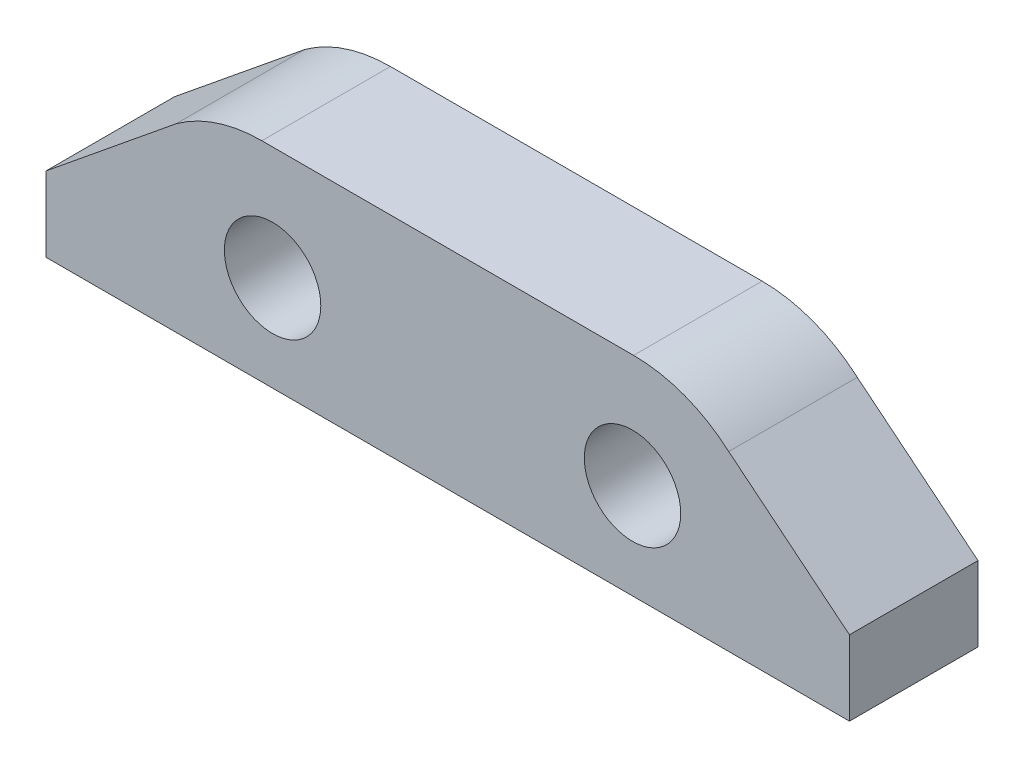
ISO-10303-21;
HEADER;
FILE_DESCRIPTION(('STEP AP214'),'2;1');
FILE_NAME('part.step','',(''),(''),'','','');
FILE_SCHEMA(('AUTOMOTIVE_DESIGN { 1 0 10303 214 1 1 1 1 }'));
ENDSEC;
DATA;
#1=APPLICATION_CONTEXT('core data for automotive mechanical design processes');
#2=APPLICATION_PROTOCOL_DEFINITION('international standard','automotive_design',2000,#1);
#3=PRODUCT_CONTEXT('',#1,'mechanical');
#4=PRODUCT('Part','Part','',(#3));
#5=PRODUCT_RELATED_PRODUCT_CATEGORY('part','',(#4));
#6=PRODUCT_DEFINITION_FORMATION('','',#4);
#7=PRODUCT_DEFINITION_CONTEXT('part definition',#1,'design');
#8=PRODUCT_DEFINITION('design','',#6,#7);
#9=PRODUCT_DEFINITION_SHAPE('','',#8);
#10=(LENGTH_UNIT() NAMED_UNIT(*) SI_UNIT(.MILLI.,.METRE.));
#11=(NAMED_UNIT(*) PLANE_ANGLE_UNIT() SI_UNIT($,.RADIAN.));
#12=(NAMED_UNIT(*) SI_UNIT($,.STERADIAN.) SOLID_ANGLE_UNIT());
#13=UNCERTAINTY_MEASURE_WITH_UNIT(LENGTH_MEASURE(1.E-05),#10,'distance_accuracy_value','');
#14=(GEOMETRIC_REPRESENTATION_CONTEXT(3) GLOBAL_UNCERTAINTY_ASSIGNED_CONTEXT((#13)) GLOBAL_UNIT_ASSIGNED_CONTEXT((#10,
#11,#12)) REPRESENTATION_CONTEXT('',''));
#15=CARTESIAN_POINT('',(0.,0.,0.));
#16=DIRECTION('',(0.,0.,1.));
#17=DIRECTION('',(1.,0.,0.));
#18=AXIS2_PLACEMENT_3D('',#15,#16,#17);
#19=CARTESIAN_POINT('',(11.1165308610014,13.6417056667107,8.00000018998981));
#20=DIRECTION('',(-0.631709390002312,-0.775205293185558,0.));
#21=DIRECTION('',(0.775205293185558,-0.631709390002312,0.));
#22=AXIS2_PLACEMENT_3D('',#19,#20,#21);
#23=PLANE('',#22);
#24=DIRECTION('',(-0.775205293185558,0.631709390002312,0.));
#25=VECTOR('',#24,1.);
#26=CARTESIAN_POINT('',(11.1165308610014,13.6417056667107,4.00000018998981));
#27=LINE('',#26,#25);
#28=CARTESIAN_POINT('',(25.0000022351742,2.32816161587835,4.00000018998981));
#29=VERTEX_POINT('',#28);
#30=CARTESIAN_POINT('',(21.2440187194801,5.38888640248,4.00000018998981));
#31=VERTEX_POINT('',#30);
#32=EDGE_CURVE('E155',#29,#31,#27,.T.);
#33=ORIENTED_EDGE('',*,*,#32,.T.);
#34=DIRECTION('',(0.,0.,-1.));
#35=VECTOR('',#34,1.);
#36=CARTESIAN_POINT('',(21.2440187194801,5.38888640248,8.00000018998981));
#37=LINE('',#36,#35);
#38=CARTESIAN_POINT('',(21.2440187194801,5.38888640248,8.00000018998981));
#39=VERTEX_POINT('',#38);
#40=EDGE_CURVE('E11',#39,#31,#37,.T.);
#41=ORIENTED_EDGE('',*,*,#40,.F.);
#42=DIRECTION('',(-0.775205293185558,0.631709390002312,0.));
#43=VECTOR('',#42,1.);
#44=CARTESIAN_POINT('',(11.1165308610014,13.6417056667107,8.00000018998981));
#45=LINE('',#44,#43);
#46=CARTESIAN_POINT('',(25.0000022351742,2.32816161587835,8.00000018998981));
#47=VERTEX_POINT('',#46);
#48=EDGE_CURVE('E218',#47,#39,#45,.T.);
#49=ORIENTED_EDGE('',*,*,#48,.F.);
#50=DIRECTION('',(0.,0.,-1.));
#51=VECTOR('',#50,1.);
#52=CARTESIAN_POINT('',(25.0000022351742,2.32816161587835,8.00000018998981));
#53=LINE('',#52,#51);
#54=EDGE_CURVE('E63',#47,#29,#53,.T.);
#55=ORIENTED_EDGE('',*,*,#54,.T.);
#56=EDGE_LOOP('',(#33,#41,#49,#55));
#57=FACE_BOUND('',#56,.T.);
#58=ADVANCED_FACE('F45',(#57),#23,.F.);
#59=CARTESIAN_POINT('',(18.2833691493808,2.00000004058979,8.00000018998981));
#60=DIRECTION('',(0.,0.,-1.));
#61=DIRECTION('',(-1.,0.,0.));
#62=AXIS2_PLACEMENT_3D('',#59,#60,#61);
#63=CYLINDRICAL_SURFACE('',#62,4.49999962785938);
#64=CARTESIAN_POINT('',(18.2833691493808,2.00000004058979,4.00000018998981));
#65=DIRECTION('',(0.,0.,1.));
#66=DIRECTION('',(1.,0.,0.));
#67=AXIS2_PLACEMENT_3D('',#64,#65,#66);
#68=CIRCLE('',#67,4.49999962785938);
#69=CARTESIAN_POINT('',(18.2833691493808,6.49999966844917,4.00000018998981));
#70=VERTEX_POINT('',#69);
#71=EDGE_CURVE('E158',#31,#70,#68,.T.);
#72=ORIENTED_EDGE('',*,*,#71,.T.);
#73=DIRECTION('',(0.,0.,-1.));
#74=VECTOR('',#73,1.);
#75=CARTESIAN_POINT('',(18.2833691493808,6.49999966844917,8.00000018998981));
#76=LINE('',#75,#74);
#77=CARTESIAN_POINT('',(18.2833691493808,6.49999966844917,8.00000018998981));
#78=VERTEX_POINT('',#77);
#79=EDGE_CURVE('E55',#78,#70,#76,.T.);
#80=ORIENTED_EDGE('',*,*,#79,.F.);
#81=CARTESIAN_POINT('',(18.2833691493808,2.00000004058979,8.00000018998981));
#82=DIRECTION('',(0.,0.,1.));
#83=DIRECTION('',(1.,0.,0.));
#84=AXIS2_PLACEMENT_3D('',#81,#82,#83);
#85=CIRCLE('',#84,4.49999962785938);
#86=EDGE_CURVE('E101',#39,#78,#85,.T.);
#87=ORIENTED_EDGE('',*,*,#86,.F.);
#88=ORIENTED_EDGE('',*,*,#40,.T.);
#89=EDGE_LOOP('',(#72,#80,#87,#88));
#90=FACE_BOUND('',#89,.T.);
#91=ADVANCED_FACE('F202',(#90),#63,.T.);
#92=CARTESIAN_POINT('',(0.,6.49999966844917,8.00000018998981));
#93=DIRECTION('',(0.,1.,0.));
#94=DIRECTION('',(0.,0.,1.));
#95=AXIS2_PLACEMENT_3D('',#92,#93,#94);
#96=PLANE('',#95);
#97=DIRECTION('',(1.,0.,0.));
#98=VECTOR('',#97,1.);
#99=CARTESIAN_POINT('',(0.,6.49999966844917,4.00000018998981));
#100=LINE('',#99,#98);
#101=CARTESIAN_POINT('',(6.71664103744792,6.49999966844917,4.00000018998981));
#102=VERTEX_POINT('',#101);
#103=EDGE_CURVE('E162',#102,#70,#100,.T.);
#104=ORIENTED_EDGE('',*,*,#103,.F.);
#105=DIRECTION('',(0.,0.,-1.));
#106=VECTOR('',#105,1.);
#107=CARTESIAN_POINT('',(6.71664103744792,6.49999966844917,8.00000018998981));
#108=LINE('',#107,#106);
#109=CARTESIAN_POINT('',(6.71664103744792,6.49999966844917,8.00000018998981));
#110=VERTEX_POINT('',#109);
#111=EDGE_CURVE('E193',#110,#102,#108,.T.);
#112=ORIENTED_EDGE('',*,*,#111,.F.);
#113=DIRECTION('',(1.,0.,0.));
#114=VECTOR('',#113,1.);
#115=CARTESIAN_POINT('',(0.,6.49999966844917,8.00000018998981));
#116=LINE('',#115,#114);
#117=EDGE_CURVE('E201',#110,#78,#116,.T.);
#118=ORIENTED_EDGE('',*,*,#117,.T.);
#119=ORIENTED_EDGE('',*,*,#79,.T.);
#120=EDGE_LOOP('',(#104,#112,#118,#119));
#121=FACE_BOUND('',#120,.T.);
#122=ADVANCED_FACE('F199',(#121),#96,.T.);
#123=CARTESIAN_POINT('',(6.71664103744792,1.99999425242705,8.00000018998981));
#124=DIRECTION('',(0.,0.,-1.));
#125=DIRECTION('',(-1.,0.,0.));
#126=AXIS2_PLACEMENT_3D('',#123,#124,#125);
#127=CYLINDRICAL_SURFACE('',#126,4.5000058794986);
#128=CARTESIAN_POINT('',(6.71664103744792,1.99999425242705,4.00000018998981));
#129=DIRECTION('',(0.,0.,1.));
#130=DIRECTION('',(1.,0.,0.));
#131=AXIS2_PLACEMENT_3D('',#128,#129,#130);
#132=CIRCLE('',#131,4.5000058794986);
#133=CARTESIAN_POINT('',(4.05098088900896,5.62550291464818,4.00000018998981));
#134=VERTEX_POINT('',#133);
#135=EDGE_CURVE('E166',#102,#134,#132,.T.);
#136=ORIENTED_EDGE('',*,*,#135,.T.);
#137=DIRECTION('',(0.,0.,-1.));
#138=VECTOR('',#137,1.);
#139=CARTESIAN_POINT('',(4.05098088900896,5.62550291464818,8.00000018998981));
#140=LINE('',#139,#138);
#141=CARTESIAN_POINT('',(4.05098088900896,5.62550291464818,8.00000018998981));
#142=VERTEX_POINT('',#141);
#143=EDGE_CURVE('E190',#142,#134,#140,.T.);
#144=ORIENTED_EDGE('',*,*,#143,.F.);
#145=CARTESIAN_POINT('',(6.71664103744792,1.99999425242705,8.00000018998981));
#146=DIRECTION('',(0.,0.,1.));
#147=DIRECTION('',(1.,0.,0.));
#148=AXIS2_PLACEMENT_3D('',#145,#146,#147);
#149=CIRCLE('',#148,4.5000058794986);
#150=EDGE_CURVE('E212',#110,#142,#149,.T.);
#151=ORIENTED_EDGE('',*,*,#150,.F.);
#152=ORIENTED_EDGE('',*,*,#111,.T.);
#153=EDGE_LOOP('',(#136,#144,#151,#152));
#154=FACE_BOUND('',#153,.T.);
#155=ADVANCED_FACE('F210',(#154),#127,.T.);
#156=CARTESIAN_POINT('',(-1.13984608143655,1.40036801823918,8.00000018998981));
#157=DIRECTION('',(-0.631275278582675,0.775558845382068,0.));
#158=DIRECTION('',(-0.775558845382068,-0.631275278582675,0.));
#159=AXIS2_PLACEMENT_3D('',#156,#157,#158);
#160=PLANE('',#159);
#161=DIRECTION('',(0.775558845382068,0.631275278582675,0.));
#162=VECTOR('',#161,1.);
#163=CARTESIAN_POINT('',(-1.13984608143655,1.40036801823918,4.00000018998981));
#164=LINE('',#163,#162);
#165=CARTESIAN_POINT('',(2.97609892285777E-06,2.32816161587834,4.00000018998981));
#166=VERTEX_POINT('',#165);
#167=EDGE_CURVE('E170',#166,#134,#164,.T.);
#168=ORIENTED_EDGE('',*,*,#167,.F.);
#169=DIRECTION('',(0.,0.,-1.));
#170=VECTOR('',#169,1.);
#171=CARTESIAN_POINT('',(2.97609892285777E-06,2.32816161587834,8.00000018998981));
#172=LINE('',#171,#170);
#173=CARTESIAN_POINT('',(2.97609892285777E-06,2.32816161587834,8.00000018998981));
#174=VERTEX_POINT('',#173);
#175=EDGE_CURVE('E127',#174,#166,#172,.T.);
#176=ORIENTED_EDGE('',*,*,#175,.F.);
#177=DIRECTION('',(0.775558845382068,0.631275278582675,0.));
#178=VECTOR('',#177,1.);
#179=CARTESIAN_POINT('',(-1.13984608143655,1.40036801823918,8.00000018998981));
#180=LINE('',#179,#178);
#181=EDGE_CURVE('E136',#174,#142,#180,.T.);
#182=ORIENTED_EDGE('',*,*,#181,.T.);
#183=ORIENTED_EDGE('',*,*,#143,.T.);
#184=EDGE_LOOP('',(#168,#176,#182,#183));
#185=FACE_BOUND('',#184,.T.);
#186=ADVANCED_FACE('F223',(#185),#160,.T.);
#187=CARTESIAN_POINT('',(0.,0.,8.00000018998981));
#188=DIRECTION('',(-0.999999999999183,1.27830426485773E-06,0.));
#189=DIRECTION('',(-1.27830426485773E-06,-0.999999999999183,0.));
#190=AXIS2_PLACEMENT_3D('',#187,#188,#189);
#191=PLANE('',#190);
#192=DIRECTION('',(1.27830426485773E-06,0.999999999999183,0.));
#193=VECTOR('',#192,1.);
#194=CARTESIAN_POINT('',(0.,0.,4.00000018998981));
#195=LINE('',#194,#193);
#196=CARTESIAN_POINT('',(0.,0.,4.00000018998981));
#197=VERTEX_POINT('',#196);
#198=EDGE_CURVE('E122',#197,#166,#195,.T.);
#199=ORIENTED_EDGE('',*,*,#198,.F.);
#200=DIRECTION('',(0.,0.,-1.));
#201=VECTOR('',#200,1.);
#202=CARTESIAN_POINT('',(0.,0.,8.00000018998981));
#203=LINE('',#202,#201);
#204=CARTESIAN_POINT('',(0.,0.,8.00000018998981));
#205=VERTEX_POINT('',#204);
#206=EDGE_CURVE('E117',#205,#197,#203,.T.);
#207=ORIENTED_EDGE('',*,*,#206,.F.);
#208=DIRECTION('',(1.27830426485773E-06,0.999999999999183,0.));
#209=VECTOR('',#208,1.);
#210=CARTESIAN_POINT('',(0.,0.,8.00000018998981));
#211=LINE('',#210,#209);
#212=EDGE_CURVE('E120',#205,#174,#211,.T.);
#213=ORIENTED_EDGE('',*,*,#212,.T.);
#214=ORIENTED_EDGE('',*,*,#175,.T.);
#215=EDGE_LOOP('',(#199,#207,#213,#214));
#216=FACE_BOUND('',#215,.T.);
#217=ADVANCED_FACE('F119',(#216),#191,.T.);
#218=CARTESIAN_POINT('',(0.,0.,8.00000018998981));
#219=DIRECTION('',(0.,-1.,0.));
#220=DIRECTION('',(0.,0.,-1.));
#221=AXIS2_PLACEMENT_3D('',#218,#219,#220);
#222=PLANE('',#221);
#223=DIRECTION('',(-1.,0.,0.));
#224=VECTOR('',#223,1.);
#225=CARTESIAN_POINT('',(0.,0.,4.00000018998981));
#226=LINE('',#225,#224);
#227=CARTESIAN_POINT('',(25.0000022351742,0.,4.00000018998981));
#228=VERTEX_POINT('',#227);
#229=EDGE_CURVE('E176',#228,#197,#226,.T.);
#230=ORIENTED_EDGE('',*,*,#229,.F.);
#231=DIRECTION('',(0.,0.,-1.));
#232=VECTOR('',#231,1.);
#233=CARTESIAN_POINT('',(25.0000022351742,0.,8.00000018998981));
#234=LINE('',#233,#232);
#235=CARTESIAN_POINT('',(25.0000022351742,0.,8.00000018998981));
#236=VERTEX_POINT('',#235);
#237=EDGE_CURVE('E89',#236,#228,#234,.T.);
#238=ORIENTED_EDGE('',*,*,#237,.F.);
#239=DIRECTION('',(-1.,0.,0.));
#240=VECTOR('',#239,1.);
#241=CARTESIAN_POINT('',(0.,0.,8.00000018998981));
#242=LINE('',#241,#240);
#243=EDGE_CURVE('E134',#236,#205,#242,.T.);
#244=ORIENTED_EDGE('',*,*,#243,.T.);
#245=ORIENTED_EDGE('',*,*,#206,.T.);
#246=EDGE_LOOP('',(#230,#238,#244,#245));
#247=FACE_BOUND('',#246,.T.);
#248=ADVANCED_FACE('F139',(#247),#222,.T.);
#249=CARTESIAN_POINT('',(18.2500032708291,2.97000004291022,8.00000018998981));
#250=DIRECTION('',(0.,0.,-1.));
#251=DIRECTION('',(-1.,0.,0.));
#252=AXIS2_PLACEMENT_3D('',#249,#250,#251);
#253=CYLINDRICAL_SURFACE('',#252,1.5000001446866);
#254=CARTESIAN_POINT('',(18.2500032708291,2.97000004291022,8.00000018998981));
#255=DIRECTION('',(0.,0.,1.));
#256=DIRECTION('',(1.,0.,0.));
#257=AXIS2_PLACEMENT_3D('',#254,#255,#256);
#258=CIRCLE('',#257,1.5000001446866);
#259=CARTESIAN_POINT('',(19.7500034155157,2.97000004291022,8.00000018998981));
#260=VERTEX_POINT('',#259);
#261=EDGE_CURVE('E252',#260,#260,#258,.T.);
#262=ORIENTED_EDGE('',*,*,#261,.T.);
#263=EDGE_LOOP('',(#262));
#264=FACE_BOUND('',#263,.T.);
#265=CARTESIAN_POINT('',(18.2500032708291,2.97000004291022,4.00000018998981));
#266=DIRECTION('',(0.,0.,1.));
#267=DIRECTION('',(1.,0.,0.));
#268=AXIS2_PLACEMENT_3D('',#265,#266,#267);
#269=CIRCLE('',#268,1.5000001446866);
#270=CARTESIAN_POINT('',(19.7500034155157,2.97000004291022,4.00000018998981));
#271=VERTEX_POINT('',#270);
#272=EDGE_CURVE('E151',#271,#271,#269,.T.);
#273=ORIENTED_EDGE('',*,*,#272,.F.);
#274=EDGE_LOOP('',(#273));
#275=FACE_BOUND('',#274,.T.);
#276=ADVANCED_FACE('F233',(#264,#275),#253,.F.);
#277=CARTESIAN_POINT('',(7.05000321150088,2.96999983845898,8.00000018998981));
#278=DIRECTION('',(0.,0.,-1.));
#279=DIRECTION('',(-1.,0.,0.));
#280=AXIS2_PLACEMENT_3D('',#277,#278,#279);
#281=CYLINDRICAL_SURFACE('',#280,1.49999995946623);
#282=CARTESIAN_POINT('',(7.05000321150088,2.96999983845898,8.00000018998981));
#283=DIRECTION('',(0.,0.,1.));
#284=DIRECTION('',(1.,0.,0.));
#285=AXIS2_PLACEMENT_3D('',#282,#283,#284);
#286=CIRCLE('',#285,1.49999995946623);
#287=CARTESIAN_POINT('',(8.55000317096711,2.96999983845898,8.00000018998981));
#288=VERTEX_POINT('',#287);
#289=EDGE_CURVE('E183',#288,#288,#286,.T.);
#290=ORIENTED_EDGE('',*,*,#289,.T.);
#291=EDGE_LOOP('',(#290));
#292=FACE_BOUND('',#291,.T.);
#293=CARTESIAN_POINT('',(7.05000321150088,2.96999983845898,4.00000018998981));
#294=DIRECTION('',(0.,0.,1.));
#295=DIRECTION('',(1.,0.,0.));
#296=AXIS2_PLACEMENT_3D('',#293,#294,#295);
#297=CIRCLE('',#296,1.49999995946623);
#298=CARTESIAN_POINT('',(8.55000317096711,2.96999983845898,4.00000018998981));
#299=VERTEX_POINT('',#298);
#300=EDGE_CURVE('E147',#299,#299,#297,.T.);
#301=ORIENTED_EDGE('',*,*,#300,.F.);
#302=EDGE_LOOP('',(#301));
#303=FACE_BOUND('',#302,.T.);
#304=ADVANCED_FACE('F47',(#292,#303),#281,.F.);
#305=CARTESIAN_POINT('',(25.0000022351742,0.,8.00000018998981));
#306=DIRECTION('',(1.,0.,0.));
#307=DIRECTION('',(0.,0.,-1.));
#308=AXIS2_PLACEMENT_3D('',#305,#306,#307);
#309=PLANE('',#308);
#310=DIRECTION('',(0.,-1.,0.));
#311=VECTOR('',#310,1.);
#312=CARTESIAN_POINT('',(25.0000022351742,0.,4.00000018998981));
#313=LINE('',#312,#311);
#314=EDGE_CURVE('E179',#29,#228,#313,.T.);
#315=ORIENTED_EDGE('',*,*,#314,.F.);
#316=ORIENTED_EDGE('',*,*,#54,.F.);
#317=DIRECTION('',(0.,-1.,0.));
#318=VECTOR('',#317,1.);
#319=CARTESIAN_POINT('',(25.0000022351742,0.,8.00000018998981));
#320=LINE('',#319,#318);
#321=EDGE_CURVE('E141',#47,#236,#320,.T.);
#322=ORIENTED_EDGE('',*,*,#321,.T.);
#323=ORIENTED_EDGE('',*,*,#237,.T.);
#324=EDGE_LOOP('',(#315,#316,#322,#323));
#325=FACE_BOUND('',#324,.T.);
#326=ADVANCED_FACE('F224',(#325),#309,.T.);
#327=CARTESIAN_POINT('',(0.,0.,8.00000018998981));
#328=DIRECTION('',(0.,0.,1.));
#329=DIRECTION('',(1.,0.,0.));
#330=AXIS2_PLACEMENT_3D('',#327,#328,#329);
#331=PLANE('',#330);
#332=ORIENTED_EDGE('',*,*,#289,.F.);
#333=EDGE_LOOP('',(#332));
#334=FACE_BOUND('',#333,.T.);
#335=ORIENTED_EDGE('',*,*,#261,.F.);
#336=EDGE_LOOP('',(#335));
#337=FACE_BOUND('',#336,.T.);
#338=ORIENTED_EDGE('',*,*,#48,.T.);
#339=ORIENTED_EDGE('',*,*,#86,.T.);
#340=ORIENTED_EDGE('',*,*,#117,.F.);
#341=ORIENTED_EDGE('',*,*,#150,.T.);
#342=ORIENTED_EDGE('',*,*,#181,.F.);
#343=ORIENTED_EDGE('',*,*,#212,.F.);
#344=ORIENTED_EDGE('',*,*,#243,.F.);
#345=ORIENTED_EDGE('',*,*,#321,.F.);
#346=EDGE_LOOP('',(#338,#339,#340,#341,#342,#343,#344,#345));
#347=FACE_BOUND('',#346,.T.);
#348=ADVANCED_FACE('F132',(#334,#337,#347),#331,.T.);
#349=CARTESIAN_POINT('',(0.,0.,4.00000018998981));
#350=DIRECTION('',(0.,0.,1.));
#351=DIRECTION('',(1.,0.,0.));
#352=AXIS2_PLACEMENT_3D('',#349,#350,#351);
#353=PLANE('',#352);
#354=ORIENTED_EDGE('',*,*,#300,.T.);
#355=EDGE_LOOP('',(#354));
#356=FACE_BOUND('',#355,.T.);
#357=ORIENTED_EDGE('',*,*,#272,.T.);
#358=EDGE_LOOP('',(#357));
#359=FACE_BOUND('',#358,.T.);
#360=ORIENTED_EDGE('',*,*,#32,.F.);
#361=ORIENTED_EDGE('',*,*,#314,.T.);
#362=ORIENTED_EDGE('',*,*,#229,.T.);
#363=ORIENTED_EDGE('',*,*,#198,.T.);
#364=ORIENTED_EDGE('',*,*,#167,.T.);
#365=ORIENTED_EDGE('',*,*,#135,.F.);
#366=ORIENTED_EDGE('',*,*,#103,.T.);
#367=ORIENTED_EDGE('',*,*,#71,.F.);
#368=EDGE_LOOP('',(#360,#361,#362,#363,#364,#365,#366,#367));
#369=FACE_BOUND('',#368,.T.);
#370=ADVANCED_FACE('F206',(#356,#359,#369),#353,.F.);
#371=CLOSED_SHELL('',(#58,#91,#122,#155,#186,#217,#248,#276,#304,#326,#348,#370));
#372=MANIFOLD_SOLID_BREP('B2',#371);
#373=ADVANCED_BREP_SHAPE_REPRESENTATION('',(#18,#372),#14);
#374=SHAPE_DEFINITION_REPRESENTATION(#9,#373);
ENDSEC;
END-ISO-10303-21;
